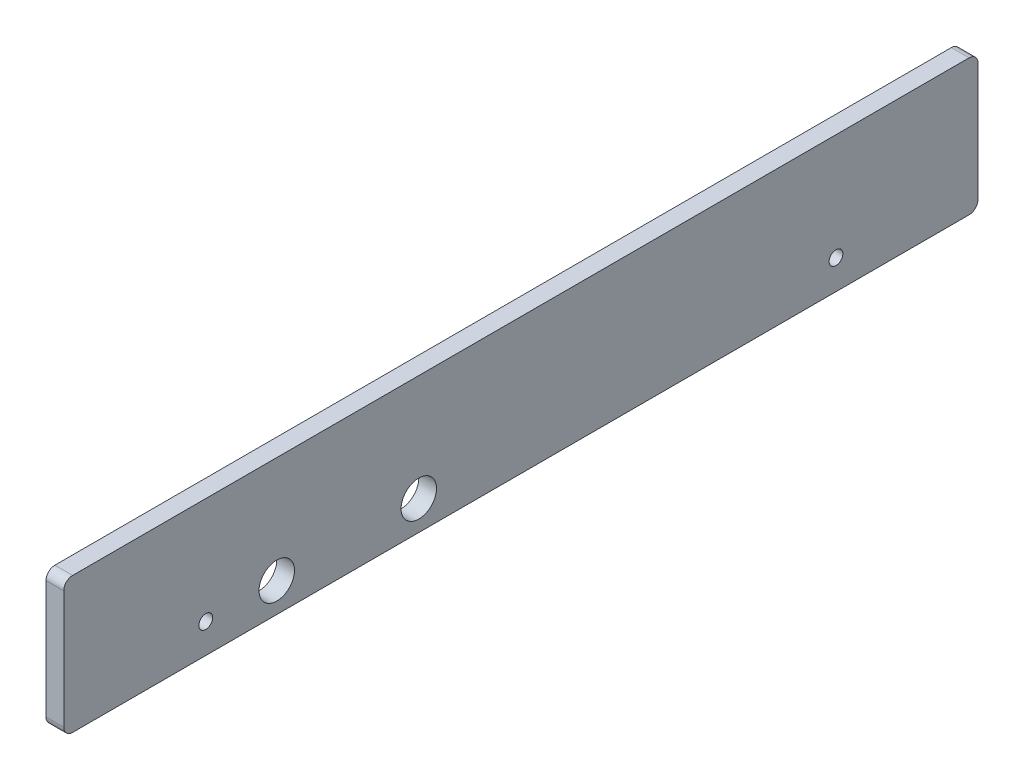
ISO-10303-21;
HEADER;
FILE_DESCRIPTION(('STEP AP214'),'2;1');
FILE_NAME('part.step','',(''),(''),'','','');
FILE_SCHEMA(('AUTOMOTIVE_DESIGN { 1 0 10303 214 1 1 1 1 }'));
ENDSEC;
DATA;
#1=APPLICATION_CONTEXT('core data for automotive mechanical design processes');
#2=APPLICATION_PROTOCOL_DEFINITION('international standard','automotive_design',2000,#1);
#3=PRODUCT_CONTEXT('',#1,'mechanical');
#4=PRODUCT('Part','Part','',(#3));
#5=PRODUCT_RELATED_PRODUCT_CATEGORY('part','',(#4));
#6=PRODUCT_DEFINITION_FORMATION('','',#4);
#7=PRODUCT_DEFINITION_CONTEXT('part definition',#1,'design');
#8=PRODUCT_DEFINITION('design','',#6,#7);
#9=PRODUCT_DEFINITION_SHAPE('','',#8);
#10=(LENGTH_UNIT() NAMED_UNIT(*) SI_UNIT(.MILLI.,.METRE.));
#11=(NAMED_UNIT(*) PLANE_ANGLE_UNIT() SI_UNIT($,.RADIAN.));
#12=(NAMED_UNIT(*) SI_UNIT($,.STERADIAN.) SOLID_ANGLE_UNIT());
#13=UNCERTAINTY_MEASURE_WITH_UNIT(LENGTH_MEASURE(1.E-05),#10,'distance_accuracy_value','');
#14=(GEOMETRIC_REPRESENTATION_CONTEXT(3) GLOBAL_UNCERTAINTY_ASSIGNED_CONTEXT((#13)) GLOBAL_UNIT_ASSIGNED_CONTEXT((#10,
#11,#12)) REPRESENTATION_CONTEXT('',''));
#15=CARTESIAN_POINT('',(0.,0.,0.));
#16=DIRECTION('',(0.,0.,1.));
#17=DIRECTION('',(1.,0.,0.));
#18=AXIS2_PLACEMENT_3D('',#15,#16,#17);
#19=CARTESIAN_POINT('',(6.35,0.,0.));
#20=DIRECTION('',(-1.,0.,0.));
#21=DIRECTION('',(0.,0.,1.));
#22=AXIS2_PLACEMENT_3D('',#19,#20,#21);
#23=PLANE('',#22);
#24=DIRECTION('',(0.,1.,0.));
#25=VECTOR('',#24,1.);
#26=CARTESIAN_POINT('',(6.35,0.,-327.025));
#27=LINE('',#26,#25);
#28=CARTESIAN_POINT('',(6.35,3.175,-327.025));
#29=VERTEX_POINT('',#28);
#30=CARTESIAN_POINT('',(6.35,45.46092,-327.025));
#31=VERTEX_POINT('',#30);
#32=EDGE_CURVE('E175',#29,#31,#27,.T.);
#33=ORIENTED_EDGE('',*,*,#32,.T.);
#34=CARTESIAN_POINT('',(6.35,45.46092,-323.85));
#35=DIRECTION('',(-1.,0.,0.));
#36=DIRECTION('',(0.,0.,1.));
#37=AXIS2_PLACEMENT_3D('',#34,#35,#36);
#38=CIRCLE('',#37,3.175);
#39=CARTESIAN_POINT('',(6.35,48.63592,-323.85));
#40=VERTEX_POINT('',#39);
#41=EDGE_CURVE('E152',#31,#40,#38,.F.);
#42=ORIENTED_EDGE('',*,*,#41,.T.);
#43=DIRECTION('',(0.,0.,1.));
#44=VECTOR('',#43,1.);
#45=CARTESIAN_POINT('',(6.35,48.63592,0.));
#46=LINE('',#45,#44);
#47=CARTESIAN_POINT('',(6.35,48.63592,-3.175));
#48=VERTEX_POINT('',#47);
#49=EDGE_CURVE('E123',#40,#48,#46,.T.);
#50=ORIENTED_EDGE('',*,*,#49,.T.);
#51=CARTESIAN_POINT('',(6.35,45.46092,-3.175));
#52=DIRECTION('',(-1.,0.,0.));
#53=DIRECTION('',(0.,0.,1.));
#54=AXIS2_PLACEMENT_3D('',#51,#52,#53);
#55=CIRCLE('',#54,3.175);
#56=CARTESIAN_POINT('',(6.35,45.46092,0.));
#57=VERTEX_POINT('',#56);
#58=EDGE_CURVE('E147',#48,#57,#55,.F.);
#59=ORIENTED_EDGE('',*,*,#58,.T.);
#60=DIRECTION('',(0.,-1.,0.));
#61=VECTOR('',#60,1.);
#62=CARTESIAN_POINT('',(6.35,0.,0.));
#63=LINE('',#62,#61);
#64=CARTESIAN_POINT('',(6.35,3.175,0.));
#65=VERTEX_POINT('',#64);
#66=EDGE_CURVE('E130',#57,#65,#63,.T.);
#67=ORIENTED_EDGE('',*,*,#66,.T.);
#68=CARTESIAN_POINT('',(6.35,3.175,-3.175));
#69=DIRECTION('',(-1.,0.,0.));
#70=DIRECTION('',(0.,0.,1.));
#71=AXIS2_PLACEMENT_3D('',#68,#69,#70);
#72=CIRCLE('',#71,3.175);
#73=CARTESIAN_POINT('',(6.35,0.,-3.175));
#74=VERTEX_POINT('',#73);
#75=EDGE_CURVE('E59',#65,#74,#72,.F.);
#76=ORIENTED_EDGE('',*,*,#75,.T.);
#77=DIRECTION('',(0.,0.,-1.));
#78=VECTOR('',#77,1.);
#79=CARTESIAN_POINT('',(6.35,0.,0.));
#80=LINE('',#79,#78);
#81=CARTESIAN_POINT('',(6.35,0.,-323.85));
#82=VERTEX_POINT('',#81);
#83=EDGE_CURVE('E133',#74,#82,#80,.T.);
#84=ORIENTED_EDGE('',*,*,#83,.T.);
#85=CARTESIAN_POINT('',(6.35,3.175,-323.85));
#86=DIRECTION('',(-1.,0.,0.));
#87=DIRECTION('',(0.,0.,1.));
#88=AXIS2_PLACEMENT_3D('',#85,#86,#87);
#89=CIRCLE('',#88,3.175);
#90=EDGE_CURVE('E150',#82,#29,#89,.F.);
#91=ORIENTED_EDGE('',*,*,#90,.T.);
#92=EDGE_LOOP('',(#33,#42,#50,#59,#67,#76,#84,#91));
#93=FACE_BOUND('',#92,.T.);
#94=CARTESIAN_POINT('',(6.35,10.53592,-50.8));
#95=DIRECTION('',(1.,0.,0.));
#96=DIRECTION('',(0.,0.,-1.));
#97=AXIS2_PLACEMENT_3D('',#94,#95,#96);
#98=CIRCLE('',#97,2.45745);
#99=CARTESIAN_POINT('',(6.35,10.53592,-53.25745));
#100=VERTEX_POINT('',#99);
#101=EDGE_CURVE('E168',#100,#100,#98,.T.);
#102=ORIENTED_EDGE('',*,*,#101,.F.);
#103=EDGE_LOOP('',(#102));
#104=FACE_BOUND('',#103,.T.);
#105=CARTESIAN_POINT('',(6.35,10.53592,-276.225));
#106=DIRECTION('',(1.,0.,0.));
#107=DIRECTION('',(0.,0.,-1.));
#108=AXIS2_PLACEMENT_3D('',#105,#106,#107);
#109=CIRCLE('',#108,2.45745000000002);
#110=CARTESIAN_POINT('',(6.35,10.53592,-278.68245));
#111=VERTEX_POINT('',#110);
#112=EDGE_CURVE('E180',#111,#111,#109,.T.);
#113=ORIENTED_EDGE('',*,*,#112,.F.);
#114=EDGE_LOOP('',(#113));
#115=FACE_BOUND('',#114,.T.);
#116=CARTESIAN_POINT('',(6.35,10.53592,-76.2));
#117=DIRECTION('',(1.,0.,0.));
#118=DIRECTION('',(0.,0.,-1.));
#119=AXIS2_PLACEMENT_3D('',#116,#117,#118);
#120=CIRCLE('',#119,6.35);
#121=CARTESIAN_POINT('',(6.35,10.53592,-82.55));
#122=VERTEX_POINT('',#121);
#123=EDGE_CURVE('E185',#122,#122,#120,.T.);
#124=ORIENTED_EDGE('',*,*,#123,.F.);
#125=EDGE_LOOP('',(#124));
#126=FACE_BOUND('',#125,.T.);
#127=CARTESIAN_POINT('',(6.35,10.53592,-127.));
#128=DIRECTION('',(1.,0.,0.));
#129=DIRECTION('',(0.,0.,-1.));
#130=AXIS2_PLACEMENT_3D('',#127,#128,#129);
#131=CIRCLE('',#130,6.35);
#132=CARTESIAN_POINT('',(6.35,10.53592,-133.35));
#133=VERTEX_POINT('',#132);
#134=EDGE_CURVE('E191',#133,#133,#131,.T.);
#135=ORIENTED_EDGE('',*,*,#134,.F.);
#136=EDGE_LOOP('',(#135));
#137=FACE_BOUND('',#136,.T.);
#138=ADVANCED_FACE('F37',(#93,#104,#115,#126,#137),#23,.F.);
#139=CARTESIAN_POINT('',(0.,0.,0.));
#140=DIRECTION('',(-1.,0.,0.));
#141=DIRECTION('',(0.,0.,1.));
#142=AXIS2_PLACEMENT_3D('',#139,#140,#141);
#143=PLANE('',#142);
#144=CARTESIAN_POINT('',(0.,10.53592,-76.2));
#145=DIRECTION('',(1.,0.,0.));
#146=DIRECTION('',(0.,0.,-1.));
#147=AXIS2_PLACEMENT_3D('',#144,#145,#146);
#148=CIRCLE('',#147,6.35);
#149=CARTESIAN_POINT('',(0.,10.53592,-82.55));
#150=VERTEX_POINT('',#149);
#151=EDGE_CURVE('E188',#150,#150,#148,.T.);
#152=ORIENTED_EDGE('',*,*,#151,.T.);
#153=EDGE_LOOP('',(#152));
#154=FACE_BOUND('',#153,.T.);
#155=CARTESIAN_POINT('',(0.,10.53592,-50.8));
#156=DIRECTION('',(1.,0.,0.));
#157=DIRECTION('',(0.,0.,-1.));
#158=AXIS2_PLACEMENT_3D('',#155,#156,#157);
#159=CIRCLE('',#158,2.45745);
#160=CARTESIAN_POINT('',(0.,10.53592,-53.25745));
#161=VERTEX_POINT('',#160);
#162=EDGE_CURVE('E171',#161,#161,#159,.T.);
#163=ORIENTED_EDGE('',*,*,#162,.T.);
#164=EDGE_LOOP('',(#163));
#165=FACE_BOUND('',#164,.T.);
#166=DIRECTION('',(0.,0.,1.));
#167=VECTOR('',#166,1.);
#168=CARTESIAN_POINT('',(0.,48.63592,0.));
#169=LINE('',#168,#167);
#170=CARTESIAN_POINT('',(0.,48.63592,-323.85));
#171=VERTEX_POINT('',#170);
#172=CARTESIAN_POINT('',(0.,48.63592,-3.175));
#173=VERTEX_POINT('',#172);
#174=EDGE_CURVE('E120',#171,#173,#169,.T.);
#175=ORIENTED_EDGE('',*,*,#174,.F.);
#176=CARTESIAN_POINT('',(0.,45.46092,-323.85));
#177=DIRECTION('',(-1.,0.,0.));
#178=DIRECTION('',(0.,0.,1.));
#179=AXIS2_PLACEMENT_3D('',#176,#177,#178);
#180=CIRCLE('',#179,3.175);
#181=CARTESIAN_POINT('',(0.,45.46092,-327.025));
#182=VERTEX_POINT('',#181);
#183=EDGE_CURVE('E103',#171,#182,#180,.T.);
#184=ORIENTED_EDGE('',*,*,#183,.T.);
#185=DIRECTION('',(0.,1.,0.));
#186=VECTOR('',#185,1.);
#187=CARTESIAN_POINT('',(0.,0.,-327.025));
#188=LINE('',#187,#186);
#189=CARTESIAN_POINT('',(0.,3.175,-327.025));
#190=VERTEX_POINT('',#189);
#191=EDGE_CURVE('E131',#190,#182,#188,.T.);
#192=ORIENTED_EDGE('',*,*,#191,.F.);
#193=CARTESIAN_POINT('',(0.,3.175,-323.85));
#194=DIRECTION('',(-1.,0.,0.));
#195=DIRECTION('',(0.,0.,1.));
#196=AXIS2_PLACEMENT_3D('',#193,#194,#195);
#197=CIRCLE('',#196,3.175);
#198=CARTESIAN_POINT('',(0.,0.,-323.85));
#199=VERTEX_POINT('',#198);
#200=EDGE_CURVE('E114',#190,#199,#197,.T.);
#201=ORIENTED_EDGE('',*,*,#200,.T.);
#202=DIRECTION('',(0.,0.,-1.));
#203=VECTOR('',#202,1.);
#204=CARTESIAN_POINT('',(0.,0.,0.));
#205=LINE('',#204,#203);
#206=CARTESIAN_POINT('',(0.,0.,-3.175));
#207=VERTEX_POINT('',#206);
#208=EDGE_CURVE('E135',#207,#199,#205,.T.);
#209=ORIENTED_EDGE('',*,*,#208,.F.);
#210=CARTESIAN_POINT('',(0.,3.175,-3.175));
#211=DIRECTION('',(-1.,0.,0.));
#212=DIRECTION('',(0.,0.,1.));
#213=AXIS2_PLACEMENT_3D('',#210,#211,#212);
#214=CIRCLE('',#213,3.175);
#215=CARTESIAN_POINT('',(0.,3.175,0.));
#216=VERTEX_POINT('',#215);
#217=EDGE_CURVE('E141',#207,#216,#214,.T.);
#218=ORIENTED_EDGE('',*,*,#217,.T.);
#219=DIRECTION('',(0.,-1.,0.));
#220=VECTOR('',#219,1.);
#221=CARTESIAN_POINT('',(0.,0.,0.));
#222=LINE('',#221,#220);
#223=CARTESIAN_POINT('',(0.,45.46092,0.));
#224=VERTEX_POINT('',#223);
#225=EDGE_CURVE('E163',#224,#216,#222,.T.);
#226=ORIENTED_EDGE('',*,*,#225,.F.);
#227=CARTESIAN_POINT('',(0.,45.46092,-3.175));
#228=DIRECTION('',(-1.,0.,0.));
#229=DIRECTION('',(0.,0.,1.));
#230=AXIS2_PLACEMENT_3D('',#227,#228,#229);
#231=CIRCLE('',#230,3.175);
#232=EDGE_CURVE('E124',#224,#173,#231,.T.);
#233=ORIENTED_EDGE('',*,*,#232,.T.);
#234=EDGE_LOOP('',(#175,#184,#192,#201,#209,#218,#226,#233));
#235=FACE_BOUND('',#234,.T.);
#236=CARTESIAN_POINT('',(0.,10.53592,-276.225));
#237=DIRECTION('',(1.,0.,0.));
#238=DIRECTION('',(0.,0.,-1.));
#239=AXIS2_PLACEMENT_3D('',#236,#237,#238);
#240=CIRCLE('',#239,2.45745000000002);
#241=CARTESIAN_POINT('',(0.,10.53592,-278.68245));
#242=VERTEX_POINT('',#241);
#243=EDGE_CURVE('E182',#242,#242,#240,.T.);
#244=ORIENTED_EDGE('',*,*,#243,.T.);
#245=EDGE_LOOP('',(#244));
#246=FACE_BOUND('',#245,.T.);
#247=CARTESIAN_POINT('',(0.,10.53592,-127.));
#248=DIRECTION('',(1.,0.,0.));
#249=DIRECTION('',(0.,0.,-1.));
#250=AXIS2_PLACEMENT_3D('',#247,#248,#249);
#251=CIRCLE('',#250,6.35);
#252=CARTESIAN_POINT('',(0.,10.53592,-133.35));
#253=VERTEX_POINT('',#252);
#254=EDGE_CURVE('E194',#253,#253,#251,.T.);
#255=ORIENTED_EDGE('',*,*,#254,.T.);
#256=EDGE_LOOP('',(#255));
#257=FACE_BOUND('',#256,.T.);
#258=ADVANCED_FACE('F127',(#154,#165,#235,#246,#257),#143,.T.);
#259=CARTESIAN_POINT('',(6.35,0.,0.));
#260=DIRECTION('',(0.,0.,-1.));
#261=DIRECTION('',(-1.,0.,0.));
#262=AXIS2_PLACEMENT_3D('',#259,#260,#261);
#263=PLANE('',#262);
#264=ORIENTED_EDGE('',*,*,#225,.T.);
#265=DIRECTION('',(-1.,0.,0.));
#266=VECTOR('',#265,1.);
#267=CARTESIAN_POINT('',(6.35,3.175,0.));
#268=LINE('',#267,#266);
#269=EDGE_CURVE('E11',#216,#65,#268,.F.);
#270=ORIENTED_EDGE('',*,*,#269,.T.);
#271=ORIENTED_EDGE('',*,*,#66,.F.);
#272=DIRECTION('',(-1.,0.,0.));
#273=VECTOR('',#272,1.);
#274=CARTESIAN_POINT('',(6.35,45.46092,0.));
#275=LINE('',#274,#273);
#276=EDGE_CURVE('E45',#57,#224,#275,.T.);
#277=ORIENTED_EDGE('',*,*,#276,.T.);
#278=EDGE_LOOP('',(#264,#270,#271,#277));
#279=FACE_BOUND('',#278,.T.);
#280=ADVANCED_FACE('F162',(#279),#263,.F.);
#281=CARTESIAN_POINT('',(6.35,0.,0.));
#282=DIRECTION('',(0.,1.,0.));
#283=DIRECTION('',(0.,0.,1.));
#284=AXIS2_PLACEMENT_3D('',#281,#282,#283);
#285=PLANE('',#284);
#286=ORIENTED_EDGE('',*,*,#208,.T.);
#287=DIRECTION('',(-1.,0.,0.));
#288=VECTOR('',#287,1.);
#289=CARTESIAN_POINT('',(6.35,0.,-323.85));
#290=LINE('',#289,#288);
#291=EDGE_CURVE('E52',#199,#82,#290,.F.);
#292=ORIENTED_EDGE('',*,*,#291,.T.);
#293=ORIENTED_EDGE('',*,*,#83,.F.);
#294=DIRECTION('',(-1.,0.,0.));
#295=VECTOR('',#294,1.);
#296=CARTESIAN_POINT('',(6.35,0.,-3.175));
#297=LINE('',#296,#295);
#298=EDGE_CURVE('E154',#74,#207,#297,.T.);
#299=ORIENTED_EDGE('',*,*,#298,.T.);
#300=EDGE_LOOP('',(#286,#292,#293,#299));
#301=FACE_BOUND('',#300,.T.);
#302=ADVANCED_FACE('F221',(#301),#285,.F.);
#303=CARTESIAN_POINT('',(6.35,0.,-327.025));
#304=DIRECTION('',(0.,0.,1.));
#305=DIRECTION('',(1.,0.,0.));
#306=AXIS2_PLACEMENT_3D('',#303,#304,#305);
#307=PLANE('',#306);
#308=ORIENTED_EDGE('',*,*,#191,.T.);
#309=DIRECTION('',(-1.,0.,0.));
#310=VECTOR('',#309,1.);
#311=CARTESIAN_POINT('',(6.35,45.46092,-327.025));
#312=LINE('',#311,#310);
#313=EDGE_CURVE('E108',#182,#31,#312,.F.);
#314=ORIENTED_EDGE('',*,*,#313,.T.);
#315=ORIENTED_EDGE('',*,*,#32,.F.);
#316=DIRECTION('',(-1.,0.,0.));
#317=VECTOR('',#316,1.);
#318=CARTESIAN_POINT('',(6.35,3.175,-327.025));
#319=LINE('',#318,#317);
#320=EDGE_CURVE('E113',#29,#190,#319,.T.);
#321=ORIENTED_EDGE('',*,*,#320,.T.);
#322=EDGE_LOOP('',(#308,#314,#315,#321));
#323=FACE_BOUND('',#322,.T.);
#324=ADVANCED_FACE('F218',(#323),#307,.F.);
#325=CARTESIAN_POINT('',(6.35,48.63592,0.));
#326=DIRECTION('',(0.,-1.,0.));
#327=DIRECTION('',(0.,0.,-1.));
#328=AXIS2_PLACEMENT_3D('',#325,#326,#327);
#329=PLANE('',#328);
#330=ORIENTED_EDGE('',*,*,#49,.F.);
#331=DIRECTION('',(-1.,0.,0.));
#332=VECTOR('',#331,1.);
#333=CARTESIAN_POINT('',(6.35,48.63592,-323.85));
#334=LINE('',#333,#332);
#335=EDGE_CURVE('E107',#40,#171,#334,.T.);
#336=ORIENTED_EDGE('',*,*,#335,.T.);
#337=ORIENTED_EDGE('',*,*,#174,.T.);
#338=DIRECTION('',(-1.,0.,0.));
#339=VECTOR('',#338,1.);
#340=CARTESIAN_POINT('',(6.35,48.63592,-3.175));
#341=LINE('',#340,#339);
#342=EDGE_CURVE('E125',#173,#48,#341,.F.);
#343=ORIENTED_EDGE('',*,*,#342,.T.);
#344=EDGE_LOOP('',(#330,#336,#337,#343));
#345=FACE_BOUND('',#344,.T.);
#346=ADVANCED_FACE('F119',(#345),#329,.F.);
#347=CARTESIAN_POINT('',(6.35,10.53592,-50.8));
#348=DIRECTION('',(-1.,0.,0.));
#349=DIRECTION('',(0.,0.,1.));
#350=AXIS2_PLACEMENT_3D('',#347,#348,#349);
#351=CYLINDRICAL_SURFACE('',#350,2.45745);
#352=ORIENTED_EDGE('',*,*,#101,.T.);
#353=EDGE_LOOP('',(#352));
#354=FACE_BOUND('',#353,.T.);
#355=ORIENTED_EDGE('',*,*,#162,.F.);
#356=EDGE_LOOP('',(#355));
#357=FACE_BOUND('',#356,.T.);
#358=ADVANCED_FACE('F213',(#354,#357),#351,.F.);
#359=CARTESIAN_POINT('',(6.35,10.53592,-276.225));
#360=DIRECTION('',(-1.,0.,0.));
#361=DIRECTION('',(0.,0.,1.));
#362=AXIS2_PLACEMENT_3D('',#359,#360,#361);
#363=CYLINDRICAL_SURFACE('',#362,2.45745000000002);
#364=ORIENTED_EDGE('',*,*,#112,.T.);
#365=EDGE_LOOP('',(#364));
#366=FACE_BOUND('',#365,.T.);
#367=ORIENTED_EDGE('',*,*,#243,.F.);
#368=EDGE_LOOP('',(#367));
#369=FACE_BOUND('',#368,.T.);
#370=ADVANCED_FACE('F267',(#366,#369),#363,.F.);
#371=CARTESIAN_POINT('',(6.35,10.53592,-76.2));
#372=DIRECTION('',(-1.,0.,0.));
#373=DIRECTION('',(0.,0.,1.));
#374=AXIS2_PLACEMENT_3D('',#371,#372,#373);
#375=CYLINDRICAL_SURFACE('',#374,6.35);
#376=ORIENTED_EDGE('',*,*,#123,.T.);
#377=EDGE_LOOP('',(#376));
#378=FACE_BOUND('',#377,.T.);
#379=ORIENTED_EDGE('',*,*,#151,.F.);
#380=EDGE_LOOP('',(#379));
#381=FACE_BOUND('',#380,.T.);
#382=ADVANCED_FACE('F260',(#378,#381),#375,.F.);
#383=CARTESIAN_POINT('',(6.35,10.53592,-127.));
#384=DIRECTION('',(-1.,0.,0.));
#385=DIRECTION('',(0.,0.,1.));
#386=AXIS2_PLACEMENT_3D('',#383,#384,#385);
#387=CYLINDRICAL_SURFACE('',#386,6.35);
#388=ORIENTED_EDGE('',*,*,#134,.T.);
#389=EDGE_LOOP('',(#388));
#390=FACE_BOUND('',#389,.T.);
#391=ORIENTED_EDGE('',*,*,#254,.F.);
#392=EDGE_LOOP('',(#391));
#393=FACE_BOUND('',#392,.T.);
#394=ADVANCED_FACE('F200',(#390,#393),#387,.F.);
#395=CARTESIAN_POINT('',(6.35,45.46092,-323.85));
#396=DIRECTION('',(-1.,0.,0.));
#397=DIRECTION('',(0.,0.,1.));
#398=AXIS2_PLACEMENT_3D('',#395,#396,#397);
#399=CYLINDRICAL_SURFACE('',#398,3.175);
#400=ORIENTED_EDGE('',*,*,#41,.F.);
#401=ORIENTED_EDGE('',*,*,#313,.F.);
#402=ORIENTED_EDGE('',*,*,#183,.F.);
#403=ORIENTED_EDGE('',*,*,#335,.F.);
#404=EDGE_LOOP('',(#400,#401,#402,#403));
#405=FACE_BOUND('',#404,.T.);
#406=ADVANCED_FACE('F106',(#405),#399,.T.);
#407=CARTESIAN_POINT('',(6.35,3.175,-323.85));
#408=DIRECTION('',(-1.,0.,0.));
#409=DIRECTION('',(0.,0.,1.));
#410=AXIS2_PLACEMENT_3D('',#407,#408,#409);
#411=CYLINDRICAL_SURFACE('',#410,3.175);
#412=ORIENTED_EDGE('',*,*,#90,.F.);
#413=ORIENTED_EDGE('',*,*,#291,.F.);
#414=ORIENTED_EDGE('',*,*,#200,.F.);
#415=ORIENTED_EDGE('',*,*,#320,.F.);
#416=EDGE_LOOP('',(#412,#413,#414,#415));
#417=FACE_BOUND('',#416,.T.);
#418=ADVANCED_FACE('F229',(#417),#411,.T.);
#419=CARTESIAN_POINT('',(6.35,3.175,-3.175));
#420=DIRECTION('',(-1.,0.,0.));
#421=DIRECTION('',(0.,0.,1.));
#422=AXIS2_PLACEMENT_3D('',#419,#420,#421);
#423=CYLINDRICAL_SURFACE('',#422,3.175);
#424=ORIENTED_EDGE('',*,*,#75,.F.);
#425=ORIENTED_EDGE('',*,*,#269,.F.);
#426=ORIENTED_EDGE('',*,*,#217,.F.);
#427=ORIENTED_EDGE('',*,*,#298,.F.);
#428=EDGE_LOOP('',(#424,#425,#426,#427));
#429=FACE_BOUND('',#428,.T.);
#430=ADVANCED_FACE('F231',(#429),#423,.T.);
#431=CARTESIAN_POINT('',(6.35,45.46092,-3.175));
#432=DIRECTION('',(-1.,0.,0.));
#433=DIRECTION('',(0.,0.,1.));
#434=AXIS2_PLACEMENT_3D('',#431,#432,#433);
#435=CYLINDRICAL_SURFACE('',#434,3.175);
#436=ORIENTED_EDGE('',*,*,#58,.F.);
#437=ORIENTED_EDGE('',*,*,#342,.F.);
#438=ORIENTED_EDGE('',*,*,#232,.F.);
#439=ORIENTED_EDGE('',*,*,#276,.F.);
#440=EDGE_LOOP('',(#436,#437,#438,#439));
#441=FACE_BOUND('',#440,.T.);
#442=ADVANCED_FACE('F39',(#441),#435,.T.);
#443=CLOSED_SHELL('',(#138,#258,#280,#302,#324,#346,#358,#370,#382,#394,#406,#418,#430,#442));
#444=MANIFOLD_SOLID_BREP('B2',#443);
#445=ADVANCED_BREP_SHAPE_REPRESENTATION('',(#18,#444),#14);
#446=SHAPE_DEFINITION_REPRESENTATION(#9,#445);
ENDSEC;
END-ISO-10303-21;
